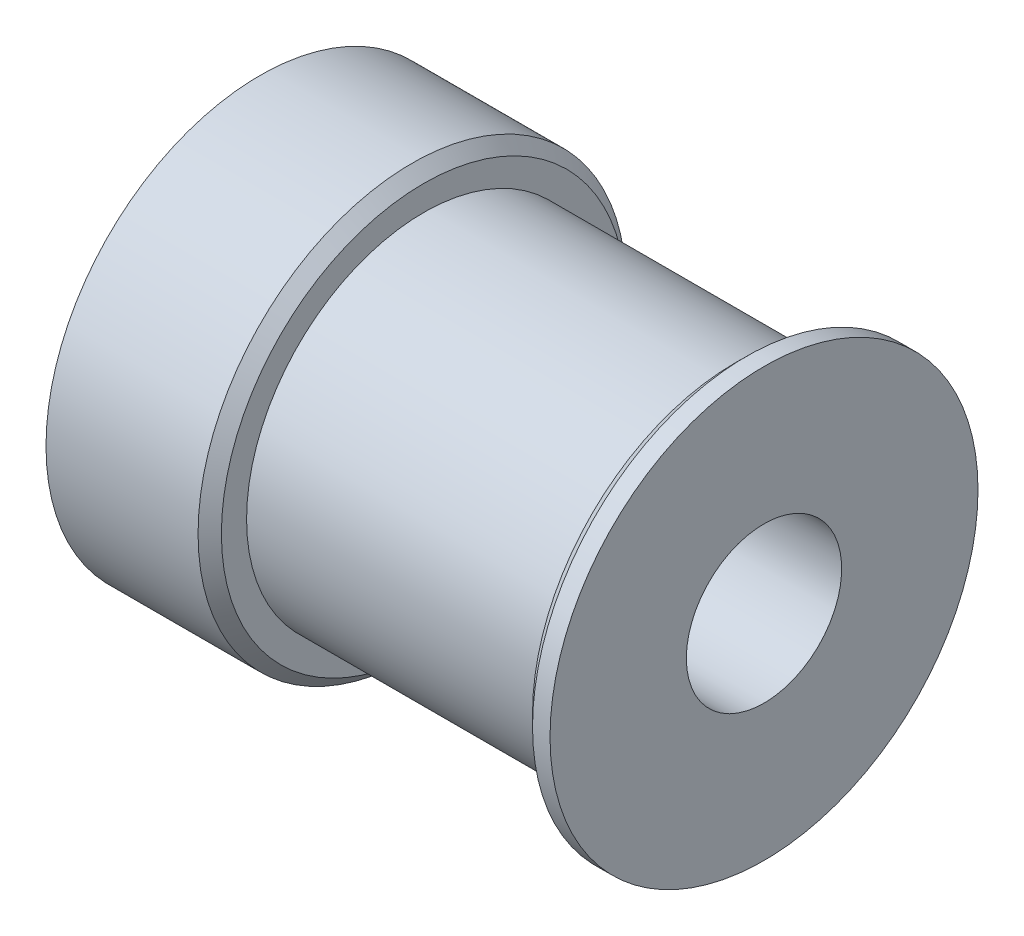
ISO-10303-21;
HEADER;
FILE_DESCRIPTION(('STEP AP214'),'2;1');
FILE_NAME('part.step','',(''),(''),'','','');
FILE_SCHEMA(('AUTOMOTIVE_DESIGN { 1 0 10303 214 1 1 1 1 }'));
ENDSEC;
DATA;
#1=APPLICATION_CONTEXT('core data for automotive mechanical design processes');
#2=APPLICATION_PROTOCOL_DEFINITION('international standard','automotive_design',2000,#1);
#3=PRODUCT_CONTEXT('',#1,'mechanical');
#4=PRODUCT('Part','Part','',(#3));
#5=PRODUCT_RELATED_PRODUCT_CATEGORY('part','',(#4));
#6=PRODUCT_DEFINITION_FORMATION('','',#4);
#7=PRODUCT_DEFINITION_CONTEXT('part definition',#1,'design');
#8=PRODUCT_DEFINITION('design','',#6,#7);
#9=PRODUCT_DEFINITION_SHAPE('','',#8);
#10=(LENGTH_UNIT() NAMED_UNIT(*) SI_UNIT(.MILLI.,.METRE.));
#11=(NAMED_UNIT(*) PLANE_ANGLE_UNIT() SI_UNIT($,.RADIAN.));
#12=(NAMED_UNIT(*) SI_UNIT($,.STERADIAN.) SOLID_ANGLE_UNIT());
#13=UNCERTAINTY_MEASURE_WITH_UNIT(LENGTH_MEASURE(1.E-05),#10,'distance_accuracy_value','');
#14=(GEOMETRIC_REPRESENTATION_CONTEXT(3) GLOBAL_UNCERTAINTY_ASSIGNED_CONTEXT((#13)) GLOBAL_UNIT_ASSIGNED_CONTEXT((#10,
#11,#12)) REPRESENTATION_CONTEXT('',''));
#15=CARTESIAN_POINT('',(0.,0.,0.));
#16=DIRECTION('',(0.,0.,1.));
#17=DIRECTION('',(1.,0.,0.));
#18=AXIS2_PLACEMENT_3D('',#15,#16,#17);
#19=CARTESIAN_POINT('',(-10.5863848396502,3.995,0.));
#20=DIRECTION('',(1.,0.,0.));
#21=DIRECTION('',(0.,0.,-1.));
#22=AXIS2_PLACEMENT_3D('',#19,#20,#21);
#23=PLANE('',#22);
#24=CARTESIAN_POINT('',(-10.5863848396502,0.,0.));
#25=DIRECTION('',(-1.,0.,0.));
#26=DIRECTION('',(0.,0.,1.));
#27=AXIS2_PLACEMENT_3D('',#24,#25,#26);
#28=CIRCLE('',#27,3.995);
#29=CARTESIAN_POINT('',(-10.5863848396502,0.,3.995));
#30=VERTEX_POINT('',#29);
#31=EDGE_CURVE('E130',#30,#30,#28,.T.);
#32=ORIENTED_EDGE('',*,*,#31,.F.);
#33=EDGE_LOOP('',(#32));
#34=FACE_BOUND('',#33,.T.);
#35=CARTESIAN_POINT('',(-10.5863848396502,0.,0.));
#36=DIRECTION('',(-1.,0.,0.));
#37=DIRECTION('',(0.,0.,1.));
#38=AXIS2_PLACEMENT_3D('',#35,#36,#37);
#39=CIRCLE('',#38,11.005);
#40=CARTESIAN_POINT('',(-10.5863848396502,0.,11.005));
#41=VERTEX_POINT('',#40);
#42=EDGE_CURVE('E51',#41,#41,#39,.T.);
#43=ORIENTED_EDGE('',*,*,#42,.T.);
#44=EDGE_LOOP('',(#43));
#45=FACE_BOUND('',#44,.T.);
#46=ADVANCED_FACE('F31',(#34,#45),#23,.F.);
#47=CARTESIAN_POINT('',(0.,0.,0.));
#48=DIRECTION('',(-1.,0.,0.));
#49=DIRECTION('',(0.,0.,1.));
#50=AXIS2_PLACEMENT_3D('',#47,#48,#49);
#51=CYLINDRICAL_SURFACE('',#50,11.005);
#52=CARTESIAN_POINT('',(-2.76638483965015,0.,0.));
#53=DIRECTION('',(-1.,0.,0.));
#54=DIRECTION('',(0.,0.,1.));
#55=AXIS2_PLACEMENT_3D('',#52,#53,#54);
#56=CIRCLE('',#55,11.005);
#57=CARTESIAN_POINT('',(-2.76638483965015,0.,11.005));
#58=VERTEX_POINT('',#57);
#59=EDGE_CURVE('E38',#58,#58,#56,.T.);
#60=ORIENTED_EDGE('',*,*,#59,.T.);
#61=EDGE_LOOP('',(#60));
#62=FACE_BOUND('',#61,.T.);
#63=CARTESIAN_POINT('',(-6.37638483965016,-10.8649677864226,1.75000000000004));
#64=CARTESIAN_POINT('',(-6.27875564989544,-10.8649694916064,1.74999602301459));
#65=CARTESIAN_POINT('',(-6.18107155983378,-10.8662979347631,1.74180252963995));
#66=CARTESIAN_POINT('',(-5.98843964425515,-10.8714639188173,1.70925666676721));
#67=CARTESIAN_POINT('',(-5.89349449972656,-10.8753038364768,1.68488899032538));
#68=CARTESIAN_POINT('',(-5.70915639548056,-10.8850471077965,1.62074662069772));
#69=CARTESIAN_POINT('',(-5.61975904141434,-10.8909488031277,1.58098430695179));
#70=CARTESIAN_POINT('',(-5.44891595170106,-10.9041486941611,1.48721143118511));
#71=CARTESIAN_POINT('',(-5.36746922898324,-10.9114467161755,1.43320264095433));
#72=CARTESIAN_POINT('',(-5.21409664057799,-10.9266902339174,1.31195211213936));
#73=CARTESIAN_POINT('',(-5.14225255934891,-10.9346404622033,1.24460750392155));
#74=CARTESIAN_POINT('',(-5.01083423974419,-10.9502504692677,1.0988192439057));
#75=CARTESIAN_POINT('',(-4.95126070342264,-10.9579102314068,1.02037495747718));
#76=CARTESIAN_POINT('',(-4.8457699857015,-10.9721260839702,0.85408690991924));
#77=CARTESIAN_POINT('',(-4.79992855043002,-10.9786759692509,0.766194520822879));
#78=CARTESIAN_POINT('',(-4.72368980285892,-10.989881522978,0.583835743244851));
#79=CARTESIAN_POINT('',(-4.69329157535639,-10.9945373036706,0.489369744708954));
#80=CARTESIAN_POINT('',(-4.64905125775586,-11.0013966685269,0.29738906255776));
#81=CARTESIAN_POINT('',(-4.63507195697558,-11.0036205646523,0.199906735509003));
#82=CARTESIAN_POINT('',(-4.62363993807174,-11.0054352942435,0.00395645500277206));
#83=CARTESIAN_POINT('',(-4.62618619302261,-11.0050262913221,-0.0945114368303926));
#84=CARTESIAN_POINT('',(-4.64762539993746,-11.001637456117,-0.288700508740375));
#85=CARTESIAN_POINT('',(-4.66637070958582,-10.9986808440948,-0.384438452056482));
#86=CARTESIAN_POINT('',(-4.71944377693937,-10.9905548695801,-0.571392458667171));
#87=CARTESIAN_POINT('',(-4.75377197525916,-10.9853854445194,-0.662608394018636));
#88=CARTESIAN_POINT('',(-4.83718517504666,-10.9733749600438,-0.838371853355376));
#89=CARTESIAN_POINT('',(-4.88633163346484,-10.9665269615087,-0.922889717834356));
#90=CARTESIAN_POINT('',(-4.99794131542398,-10.9519212841299,-1.08253455344542));
#91=CARTESIAN_POINT('',(-5.0604055221331,-10.944163538144,-1.15766083060397));
#92=CARTESIAN_POINT('',(-5.19769816413769,-10.9285010937218,-1.29726131130141));
#93=CARTESIAN_POINT('',(-5.27265557865962,-10.9205957186598,-1.36160865701711));
#94=CARTESIAN_POINT('',(-5.43237058599237,-10.9056122320807,-1.47683219989991));
#95=CARTESIAN_POINT('',(-5.51712825420994,-10.8985341269297,-1.52770829340434));
#96=CARTESIAN_POINT('',(-5.69417789876796,-10.8860064882961,-1.61456639284701));
#97=CARTESIAN_POINT('',(-5.78647696761673,-10.8805585108855,-1.65053418028916));
#98=CARTESIAN_POINT('',(-5.9759123382375,-10.8719345255966,-1.70642079649818));
#99=CARTESIAN_POINT('',(-6.07304825379961,-10.8687583366319,-1.72634090445641));
#100=CARTESIAN_POINT('',(-6.26826794976473,-10.8650722688855,-1.74939026800426));
#101=CARTESIAN_POINT('',(-6.36632991245014,-10.8645337510787,-1.75269988498944));
#102=CARTESIAN_POINT('',(-6.56160730463636,-10.8661078337943,-1.74291398581287));
#103=CARTESIAN_POINT('',(-6.6588227636665,-10.8682203414626,-1.72981904423304));
#104=CARTESIAN_POINT('',(-6.84908131822897,-10.8748320605633,-1.68774914522727));
#105=CARTESIAN_POINT('',(-6.94214502708317,-10.8793176075034,-1.65886507379704));
#106=CARTESIAN_POINT('',(-7.12211061061118,-10.8901586248279,-1.58613177998907));
#107=CARTESIAN_POINT('',(-7.20901214637249,-10.8965141979627,-1.54228173526964));
#108=CARTESIAN_POINT('',(-7.37499201562485,-10.9104461376956,-1.4404319517415));
#109=CARTESIAN_POINT('',(-7.45399824598429,-10.9180323412732,-1.38231607913724));
#110=CARTESIAN_POINT('',(-7.60120136555185,-10.9335415973798,-1.25374469544477));
#111=CARTESIAN_POINT('',(-7.66939756455878,-10.9414646713764,-1.18328839704649));
#112=CARTESIAN_POINT('',(-7.79369826263181,-10.9568450191339,-1.0312393174608));
#113=CARTESIAN_POINT('',(-7.84968283299482,-10.9642972032144,-0.949547902146971));
#114=CARTESIAN_POINT('',(-7.94713315845365,-10.9778156839733,-0.777814841909979));
#115=CARTESIAN_POINT('',(-7.98859934986523,-10.9838820222982,-0.687773448028692));
#116=CARTESIAN_POINT('',(-8.05564685579955,-10.993923094696,-0.502261191721235));
#117=CARTESIAN_POINT('',(-8.0812922515926,-10.9979062564397,-0.406813965022255));
#118=CARTESIAN_POINT('',(-8.11617704069885,-11.0033676936085,-0.212899336833813));
#119=CARTESIAN_POINT('',(-8.12541765793498,-11.0048461559032,-0.114432161213477));
#120=CARTESIAN_POINT('',(-8.12719788154438,-11.0051293329653,0.0815670735143751));
#121=CARTESIAN_POINT('',(-8.11992044113765,-11.0039633377308,0.179097477446532));
#122=CARTESIAN_POINT('',(-8.08926516642307,-10.9991480574674,0.371528467157263));
#123=CARTESIAN_POINT('',(-8.06588740324428,-10.9954987834093,0.466429064552045));
#124=CARTESIAN_POINT('',(-8.00376283369296,-10.9861252835372,0.65084591170194));
#125=CARTESIAN_POINT('',(-7.96503022954049,-10.9804029755637,0.740367049238215));
#126=CARTESIAN_POINT('',(-7.87331539727214,-10.9675098849339,0.911668383867845));
#127=CARTESIAN_POINT('',(-7.82033259278076,-10.9603390436919,0.993448267671069));
#128=CARTESIAN_POINT('',(-7.70096659691138,-10.9452505504538,1.14787034132481));
#129=CARTESIAN_POINT('',(-7.63444889092241,-10.9373258644241,1.22040787656462));
#130=CARTESIAN_POINT('',(-7.49018410785654,-10.9216730973817,1.35335675794192));
#131=CARTESIAN_POINT('',(-7.41243440307023,-10.9139450628743,1.41376525858447));
#132=CARTESIAN_POINT('',(-7.24732640756339,-10.8995075521419,1.52109167970866));
#133=CARTESIAN_POINT('',(-7.15991001286703,-10.8928048844696,1.56792112774678));
#134=CARTESIAN_POINT('',(-6.97838367097616,-10.8812571340208,1.64616089728005));
#135=CARTESIAN_POINT('',(-6.88428064564917,-10.8764101625431,1.67758690535849));
#136=CARTESIAN_POINT('',(-6.7208841865296,-10.8702187964121,1.71715731441487));
#137=CARTESIAN_POINT('',(-6.65258978684391,-10.8682603749163,1.72945399739872));
#138=CARTESIAN_POINT('',(-6.51500108740209,-10.8656342745896,1.74587668848285));
#139=CARTESIAN_POINT('',(-6.44570680324023,-10.8649665756505,1.75000282387312));
#140=CARTESIAN_POINT('',(-6.37638483965016,-10.8649677864226,1.75000000000004));
#141=B_SPLINE_CURVE_WITH_KNOTS('',3,(#63,#64,#65,#66,#67,#68,#69,#70,#71,#72,#73,#74,#75,#76,
#77,#78,#79,#80,#81,#82,#83,#84,#85,#86,#87,#88,#89,#90,#91,#92,#93,#94,#95,#96,#97,#98,#99,
#100,#101,#102,#103,#104,#105,#106,#107,#108,#109,#110,#111,#112,#113,#114,#115,#116,#117,#118,
#119,#120,#121,#122,#123,#124,#125,#126,#127,#128,#129,#130,#131,#132,#133,#134,#135,#136,#137,
#138,#139,#140),.UNSPECIFIED.,.T.,.F.,(4,2,2,2,2,2,2,2,2,2,2,2,2,2,2,2,2,2,2,2,2,2,2,2,2,2,2,2,
2,2,2,2,2,2,2,2,2,2,4),(0.,0.292634128170553,0.585545595414746,0.878222008487918,
1.17086203945359,1.46585413757004,1.76086310884996,2.05747058792093,2.35406048724384,
2.64815378117752,2.94222879983902,3.23365147810622,3.52508239702041,3.81773901631135,
4.11041724814141,4.40632908244842,4.70224319376153,4.99843888138603,5.29461095634625,
5.58756004626574,5.88049887571103,6.17176896900574,6.46305506941898,6.75679601818856,
7.05055571424524,7.34708204257179,7.64359945873092,7.93890782318109,8.23419415442473,
8.52622588859176,8.81825633260985,9.11001729549212,9.40179006095693,9.69661817589636,
9.99151537747112,10.2882928579732,10.5847674744652,10.7925566456576,11.0003425796515),.UNSPECIFIED.);
#142=CARTESIAN_POINT('',(-6.37638483965016,-10.8649677864226,1.75000000000004));
#143=VERTEX_POINT('',#142);
#144=EDGE_CURVE('E59',#143,#143,#141,.T.);
#145=ORIENTED_EDGE('',*,*,#144,.T.);
#146=EDGE_LOOP('',(#145));
#147=FACE_BOUND('',#146,.T.);
#148=CARTESIAN_POINT('',(-4.62638483965016,0.,-11.005));
#149=CARTESIAN_POINT('',(-4.62638880920645,0.0976379879757944,-11.0049983735711));
#150=CARTESIAN_POINT('',(-4.63458372956067,0.195330853503295,-11.0036870380277));
#151=CARTESIAN_POINT('',(-4.66713577467557,0.38798099709675,-10.998582102473));
#152=CARTESIAN_POINT('',(-4.69150817428676,0.482935601183339,-10.9947861565283));
#153=CARTESIAN_POINT('',(-4.75566435619124,0.667293723706856,-10.9851381495617));
#154=CARTESIAN_POINT('',(-4.79543598213992,0.756701556403332,-10.9792877107207));
#155=CARTESIAN_POINT('',(-4.88923079893324,0.927562260653505,-10.9661754967891));
#156=CARTESIAN_POINT('',(-4.94325219578225,1.00901613181525,-10.9589138993887));
#157=CARTESIAN_POINT('',(-5.06451555791497,1.1623808835496,-10.9437146074467));
#158=CARTESIAN_POINT('',(-5.13185756797195,1.23421218876728,-10.9357720715502));
#159=CARTESIAN_POINT('',(-5.27763523626369,1.36560578310539,-10.9201435240471));
#160=CARTESIAN_POINT('',(-5.35607156430421,1.42516733092067,-10.9124575279634));
#161=CARTESIAN_POINT('',(-5.52235240577917,1.53064532361661,-10.8981653828135));
#162=CARTESIAN_POINT('',(-5.61024691645186,1.57648387190399,-10.8915654906567));
#163=CARTESIAN_POINT('',(-5.79261029658337,1.65271670000419,-10.880259505857));
#164=CARTESIAN_POINT('',(-5.88707876225264,1.68311192743596,-10.8755532970193));
#165=CARTESIAN_POINT('',(-6.07906795282237,1.72734625340389,-10.8686154602757));
#166=CARTESIAN_POINT('',(-6.17655639382931,1.74132220686268,-10.8663633886903));
#167=CARTESIAN_POINT('',(-6.37251871606897,1.7527454116231,-10.8645268715548));
#168=CARTESIAN_POINT('',(-6.47099253338011,1.75019372822462,-10.8649422540722));
#169=CARTESIAN_POINT('',(-6.66515817412189,1.72874573755192,-10.8683750325878));
#170=CARTESIAN_POINT('',(-6.7608674043526,1.71000254506253,-10.8713680523848));
#171=CARTESIAN_POINT('',(-6.94776508565194,1.65694359159775,-10.8795807482602));
#172=CARTESIAN_POINT('',(-7.03895339431674,1.62262734043419,-10.8848004944282));
#173=CARTESIAN_POINT('',(-7.21468263375545,1.53923925859875,-10.8969051220884));
#174=CARTESIAN_POINT('',(-7.29919259154708,1.49010324707008,-10.9037972202345));
#175=CARTESIAN_POINT('',(-7.45882600558572,1.37851606851503,-10.9184648812809));
#176=CARTESIAN_POINT('',(-7.53394877018993,1.31606392128008,-10.9262405091986));
#177=CARTESIAN_POINT('',(-7.67356215999975,1.17878007668056,-10.9419065036017));
#178=CARTESIAN_POINT('',(-7.73792351500074,1.10381687909397,-10.9497971760545));
#179=CARTESIAN_POINT('',(-7.85317260248697,0.944085225570313,-10.9647230553611));
#180=CARTESIAN_POINT('',(-7.90406026197882,0.859316716516799,-10.9717582575802));
#181=CARTESIAN_POINT('',(-7.99092678821638,0.682263640656775,-10.9841892280718));
#182=CARTESIAN_POINT('',(-8.02689491747552,0.589973717694693,-10.9895838148619));
#183=CARTESIAN_POINT('',(-8.0827849966669,0.400558298685616,-10.9981160722856));
#184=CARTESIAN_POINT('',(-8.10270816723225,0.303433171077714,-11.001253914601));
#185=CARTESIAN_POINT('',(-8.12576912105926,0.108219263965093,-11.0048962121308));
#186=CARTESIAN_POINT('',(-8.12908448693273,0.010151963761354,-11.0054285261173));
#187=CARTESIAN_POINT('',(-8.1193081803818,-0.185137465179281,-11.0038758716671));
#188=CARTESIAN_POINT('',(-8.10621708084671,-0.282359623307915,-11.0017909946189));
#189=CARTESIAN_POINT('',(-8.06414714374553,-0.47265547349901,-10.9952554526825));
#190=CARTESIAN_POINT('',(-8.03525556422922,-0.565748941080359,-10.9908177851386));
#191=CARTESIAN_POINT('',(-7.96249734007517,-0.745770738366731,-10.980072413782));
#192=CARTESIAN_POINT('',(-7.91862991821455,-0.83269874781123,-10.9737646129147));
#193=CARTESIAN_POINT('',(-7.81675386325276,-0.99869791527865,-10.9599101102399));
#194=CARTESIAN_POINT('',(-7.75863349029645,-1.07769967827774,-10.9523537809111));
#195=CARTESIAN_POINT('',(-7.63005594007277,-1.22489170233687,-10.9368712610847));
#196=CARTESIAN_POINT('',(-7.55959795169349,-1.29308125200752,-10.9289450462949));
#197=CARTESIAN_POINT('',(-7.4075514941104,-1.41736577223755,-10.9135268254945));
#198=CARTESIAN_POINT('',(-7.32586474778272,-1.47334119728038,-10.9060395940498));
#199=CARTESIAN_POINT('',(-7.15414363820159,-1.57077549729447,-10.8924340580026));
#200=CARTESIAN_POINT('',(-7.06410952185587,-1.61223480146642,-10.886315712928));
#201=CARTESIAN_POINT('',(-6.8785941284918,-1.67927811775171,-10.8761759334255));
#202=CARTESIAN_POINT('',(-6.78313539519866,-1.70492323680364,-10.8721464373104));
#203=CARTESIAN_POINT('',(-6.58919635293697,-1.7398035801039,-10.866619792171));
#204=CARTESIAN_POINT('',(-6.49071628158279,-1.74904009146568,-10.865122444522));
#205=CARTESIAN_POINT('',(-6.29472272194748,-1.75080761094841,-10.8648376586723));
#206=CARTESIAN_POINT('',(-6.19721092250029,-1.74352668641723,-10.8660197127072));
#207=CARTESIAN_POINT('',(-6.00481805058491,-1.71287095773792,-10.8708939445795));
#208=CARTESIAN_POINT('',(-5.90993697171421,-1.68949619276176,-10.8745861163073));
#209=CARTESIAN_POINT('',(-5.72556190115534,-1.62738576953246,-10.8840534106507));
#210=CARTESIAN_POINT('',(-5.63606282759747,-1.58866487249639,-10.8898265311509));
#211=CARTESIAN_POINT('',(-5.46480078783857,-1.49698033657708,-10.9028073999666));
#212=CARTESIAN_POINT('',(-5.38303814861327,-1.44401609607069,-10.9100152088785));
#213=CARTESIAN_POINT('',(-5.22861718552694,-1.32467140198418,-10.9251506878689));
#214=CARTESIAN_POINT('',(-5.15606680921633,-1.2581521360587,-10.9330852960958));
#215=CARTESIAN_POINT('',(-5.02309274404159,-1.11387883322309,-10.9487237944648));
#216=CARTESIAN_POINT('',(-4.96267186600151,-1.03612219938978,-10.9564276307779));
#217=CARTESIAN_POINT('',(-4.85533106096996,-0.871007716111391,-10.970791884614));
#218=CARTESIAN_POINT('',(-4.80849764678914,-0.783593034670629,-10.977445498091));
#219=CARTESIAN_POINT('',(-4.73024999770739,-0.602070124389866,-10.9888932428123));
#220=CARTESIAN_POINT('',(-4.69882011601511,-0.507968799543904,-10.9936892599457));
#221=CARTESIAN_POINT('',(-4.65923957780887,-0.344562164662293,-10.9998120267978));
#222=CARTESIAN_POINT('',(-4.64693835360418,-0.276255193174896,-11.0017473109977));
#223=CARTESIAN_POINT('',(-4.63050963578979,-0.138641362212051,-11.0043418656025));
#224=CARTESIAN_POINT('',(-4.62638202079577,-0.0693345176008767,-11.0050011549569));
#225=CARTESIAN_POINT('',(-4.62638483965016,0.,-11.005));
#226=B_SPLINE_CURVE_WITH_KNOTS('',3,(#148,#149,#150,#151,#152,#153,#154,#155,#156,#157,#158,
#159,#160,#161,#162,#163,#164,#165,#166,#167,#168,#169,#170,#171,#172,#173,#174,#175,#176,#177,
#178,#179,#180,#181,#182,#183,#184,#185,#186,#187,#188,#189,#190,#191,#192,#193,#194,#195,#196,
#197,#198,#199,#200,#201,#202,#203,#204,#205,#206,#207,#208,#209,#210,#211,#212,#213,#214,#215,
#216,#217,#218,#219,#220,#221,#222,#223,#224,#225),.UNSPECIFIED.,.T.,.F.,(4,2,2,2,2,2,2,2,2,2,2,
2,2,2,2,2,2,2,2,2,2,2,2,2,2,2,2,2,2,2,2,2,2,2,2,2,2,2,4),(0.,0.292660565236477,0.58559785575936,
0.878304367798746,1.17097404669961,1.46593153851999,1.76090684564168,2.05752610276867,
2.35412715681695,2.6482380905704,2.94233006739542,3.23367103776298,3.52502117921285,
3.81765166219281,4.11030369331529,4.40625164360713,4.70220119715661,4.99836337561774,
5.29450302117457,5.58746926629496,5.88042528175621,6.17177955101898,6.46314894341372,
6.75688003733683,7.05063044927991,7.34713840896221,7.64363760100113,7.93898380354323,
8.23430683770519,8.52628422572261,8.81826090307733,9.10995741136951,9.40166624253694,
9.69652778713647,9.99145758267256,10.2882259655876,10.5846922653741,10.7925189615486,
11.0003425713151),.UNSPECIFIED.);
#227=CARTESIAN_POINT('',(-4.62638483965016,0.,-11.005));
#228=VERTEX_POINT('',#227);
#229=EDGE_CURVE('E82',#228,#228,#226,.T.);
#230=ORIENTED_EDGE('',*,*,#229,.T.);
#231=EDGE_LOOP('',(#230));
#232=FACE_BOUND('',#231,.T.);
#233=ORIENTED_EDGE('',*,*,#42,.F.);
#234=EDGE_LOOP('',(#233));
#235=FACE_BOUND('',#234,.T.);
#236=ADVANCED_FACE('F86',(#62,#147,#232,#235),#51,.T.);
#237=CARTESIAN_POINT('',(-2.16638483965016,9.11,0.));
#238=DIRECTION('',(-1.,0.,0.));
#239=DIRECTION('',(0.,0.,1.));
#240=AXIS2_PLACEMENT_3D('',#237,#238,#239);
#241=PLANE('',#240);
#242=CARTESIAN_POINT('',(-2.16638483965016,0.,0.));
#243=DIRECTION('',(-1.,0.,0.));
#244=DIRECTION('',(0.,0.,1.));
#245=AXIS2_PLACEMENT_3D('',#242,#243,#244);
#246=CIRCLE('',#245,10.405);
#247=CARTESIAN_POINT('',(-2.16638483965016,0.,10.405));
#248=VERTEX_POINT('',#247);
#249=EDGE_CURVE('E10',#248,#248,#246,.F.);
#250=ORIENTED_EDGE('',*,*,#249,.T.);
#251=EDGE_LOOP('',(#250));
#252=FACE_BOUND('',#251,.T.);
#253=CARTESIAN_POINT('',(-2.16638483965016,0.,0.));
#254=DIRECTION('',(-1.,0.,0.));
#255=DIRECTION('',(0.,0.,1.));
#256=AXIS2_PLACEMENT_3D('',#253,#254,#255);
#257=CIRCLE('',#256,9.11);
#258=CARTESIAN_POINT('',(-2.16638483965016,0.,9.11));
#259=VERTEX_POINT('',#258);
#260=EDGE_CURVE('E116',#259,#259,#257,.T.);
#261=ORIENTED_EDGE('',*,*,#260,.T.);
#262=EDGE_LOOP('',(#261));
#263=FACE_BOUND('',#262,.T.);
#264=ADVANCED_FACE('F91',(#252,#263),#241,.F.);
#265=CARTESIAN_POINT('',(0.,0.,0.));
#266=DIRECTION('',(-1.,0.,0.));
#267=DIRECTION('',(0.,0.,1.));
#268=AXIS2_PLACEMENT_3D('',#265,#266,#267);
#269=CYLINDRICAL_SURFACE('',#268,9.11);
#270=ORIENTED_EDGE('',*,*,#260,.F.);
#271=EDGE_LOOP('',(#270));
#272=FACE_BOUND('',#271,.T.);
#273=CARTESIAN_POINT('',(13.8336151603498,0.,0.));
#274=DIRECTION('',(-1.,0.,0.));
#275=DIRECTION('',(0.,0.,1.));
#276=AXIS2_PLACEMENT_3D('',#273,#274,#275);
#277=CIRCLE('',#276,9.11);
#278=CARTESIAN_POINT('',(13.8336151603498,0.,9.11));
#279=VERTEX_POINT('',#278);
#280=EDGE_CURVE('E114',#279,#279,#277,.T.);
#281=ORIENTED_EDGE('',*,*,#280,.T.);
#282=EDGE_LOOP('',(#281));
#283=FACE_BOUND('',#282,.T.);
#284=ADVANCED_FACE('F110',(#272,#283),#269,.T.);
#285=CARTESIAN_POINT('',(13.8336151603498,9.11,0.));
#286=DIRECTION('',(1.,0.,0.));
#287=DIRECTION('',(0.,0.,-1.));
#288=AXIS2_PLACEMENT_3D('',#285,#286,#287);
#289=PLANE('',#288);
#290=CARTESIAN_POINT('',(13.8336151603498,0.,0.));
#291=DIRECTION('',(1.,0.,0.));
#292=DIRECTION('',(0.,0.,-1.));
#293=AXIS2_PLACEMENT_3D('',#290,#291,#292);
#294=CIRCLE('',#293,10.405);
#295=CARTESIAN_POINT('',(13.8336151603498,0.,-10.405));
#296=VERTEX_POINT('',#295);
#297=EDGE_CURVE('E46',#296,#296,#294,.F.);
#298=ORIENTED_EDGE('',*,*,#297,.T.);
#299=EDGE_LOOP('',(#298));
#300=FACE_BOUND('',#299,.T.);
#301=ORIENTED_EDGE('',*,*,#280,.F.);
#302=EDGE_LOOP('',(#301));
#303=FACE_BOUND('',#302,.T.);
#304=ADVANCED_FACE('F106',(#300,#303),#289,.F.);
#305=CARTESIAN_POINT('',(0.,0.,0.));
#306=DIRECTION('',(-1.,0.,0.));
#307=DIRECTION('',(0.,0.,1.));
#308=AXIS2_PLACEMENT_3D('',#305,#306,#307);
#309=CYLINDRICAL_SURFACE('',#308,11.005);
#310=CARTESIAN_POINT('',(14.4336151603498,0.,0.));
#311=DIRECTION('',(1.,0.,0.));
#312=DIRECTION('',(0.,0.,-1.));
#313=AXIS2_PLACEMENT_3D('',#310,#311,#312);
#314=CIRCLE('',#313,11.005);
#315=CARTESIAN_POINT('',(14.4336151603498,0.,-11.005));
#316=VERTEX_POINT('',#315);
#317=EDGE_CURVE('E42',#316,#316,#314,.T.);
#318=ORIENTED_EDGE('',*,*,#317,.T.);
#319=EDGE_LOOP('',(#318));
#320=FACE_BOUND('',#319,.T.);
#321=CARTESIAN_POINT('',(15.3336151603498,0.,0.));
#322=DIRECTION('',(-1.,0.,0.));
#323=DIRECTION('',(0.,0.,1.));
#324=AXIS2_PLACEMENT_3D('',#321,#322,#323);
#325=CIRCLE('',#324,11.005);
#326=CARTESIAN_POINT('',(15.3336151603498,0.,11.005));
#327=VERTEX_POINT('',#326);
#328=EDGE_CURVE('E117',#327,#327,#325,.T.);
#329=ORIENTED_EDGE('',*,*,#328,.T.);
#330=EDGE_LOOP('',(#329));
#331=FACE_BOUND('',#330,.T.);
#332=ADVANCED_FACE('F109',(#320,#331),#309,.T.);
#333=CARTESIAN_POINT('',(15.3336151603498,3.995,0.));
#334=DIRECTION('',(-1.,0.,0.));
#335=DIRECTION('',(0.,0.,1.));
#336=AXIS2_PLACEMENT_3D('',#333,#334,#335);
#337=PLANE('',#336);
#338=ORIENTED_EDGE('',*,*,#328,.F.);
#339=EDGE_LOOP('',(#338));
#340=FACE_BOUND('',#339,.T.);
#341=CARTESIAN_POINT('',(15.3336151603498,0.,0.));
#342=DIRECTION('',(-1.,0.,0.));
#343=DIRECTION('',(0.,0.,1.));
#344=AXIS2_PLACEMENT_3D('',#341,#342,#343);
#345=CIRCLE('',#344,3.995);
#346=CARTESIAN_POINT('',(15.3336151603498,0.,3.995));
#347=VERTEX_POINT('',#346);
#348=EDGE_CURVE('E122',#347,#347,#345,.T.);
#349=ORIENTED_EDGE('',*,*,#348,.T.);
#350=EDGE_LOOP('',(#349));
#351=FACE_BOUND('',#350,.T.);
#352=ADVANCED_FACE('F147',(#340,#351),#337,.F.);
#353=CARTESIAN_POINT('',(0.,0.,0.));
#354=DIRECTION('',(-1.,0.,0.));
#355=DIRECTION('',(0.,0.,1.));
#356=AXIS2_PLACEMENT_3D('',#353,#354,#355);
#357=CYLINDRICAL_SURFACE('',#356,3.995);
#358=CARTESIAN_POINT('',(-6.37638483965016,-3.59131243419449,1.75000000000001));
#359=CARTESIAN_POINT('',(-6.46920856067517,-3.59131701710379,1.74999575324021));
#360=CARTESIAN_POINT('',(-6.56218618188808,-3.59496328179706,1.74256773930113));
#361=CARTESIAN_POINT('',(-6.74541509807789,-3.60905905743933,1.71317560599182));
#362=CARTESIAN_POINT('',(-6.83565873180508,-3.61952611433385,1.69117399478829));
#363=CARTESIAN_POINT('',(-7.01044065879885,-3.6458348395026,1.63367642518377));
#364=CARTESIAN_POINT('',(-7.09500200281182,-3.66165299662239,1.59823941708571));
#365=CARTESIAN_POINT('',(-7.25695693749664,-3.69684592039027,1.51505364733799));
#366=CARTESIAN_POINT('',(-7.33435169839832,-3.71622010482915,1.4673069005785));
#367=CARTESIAN_POINT('',(-7.4851556831418,-3.75783400007592,1.35733946859375));
#368=CARTESIAN_POINT('',(-7.55801256456173,-3.7801771557608,1.2944000986134));
#369=CARTESIAN_POINT('',(-7.69255037428529,-3.82436564195849,1.15733986226223));
#370=CARTESIAN_POINT('',(-7.75422672102254,-3.84621076519607,1.08321443475906));
#371=CARTESIAN_POINT('',(-7.86757700938578,-3.88822196561616,0.92144641048631));
#372=CARTESIAN_POINT('',(-7.91861544210423,-3.90825396046259,0.833320500051198));
#373=CARTESIAN_POINT('',(-8.00489993092916,-3.94309804173771,0.64869561285448));
#374=CARTESIAN_POINT('',(-8.04015369884359,-3.95791267642032,0.552200752422672));
#375=CARTESIAN_POINT('',(-8.0918224917898,-3.97991667087864,0.359389846957518));
#376=CARTESIAN_POINT('',(-8.10919383169193,-3.98749135526514,0.263374969068302));
#377=CARTESIAN_POINT('',(-8.1277090711867,-3.99557098475089,0.069514937067978));
#378=CARTESIAN_POINT('',(-8.12886029356441,-3.99607912013515,-0.0283293711434943));
#379=CARTESIAN_POINT('',(-8.11537244648357,-3.99018490766646,-0.216062029310302));
#380=CARTESIAN_POINT('',(-8.10178827905712,-3.98424420903011,-0.306043504497339));
#381=CARTESIAN_POINT('',(-8.06104250131365,-3.96676935615993,-0.482298608644567));
#382=CARTESIAN_POINT('',(-8.03387988620493,-3.95523478798717,-0.568571962694313));
#383=CARTESIAN_POINT('',(-7.96644738942268,-3.9274506819562,-0.736560854490425));
#384=CARTESIAN_POINT('',(-7.92598351494741,-3.91113177265863,-0.818186573224962));
#385=CARTESIAN_POINT('',(-7.8333003780357,-3.87534546156287,-0.973704128858783));
#386=CARTESIAN_POINT('',(-7.78107685127613,-3.8558769183571,-1.04759314597549));
#387=CARTESIAN_POINT('',(-7.66171033429825,-3.81395211408563,-1.19157041167809));
#388=CARTESIAN_POINT('',(-7.59373006560545,-3.791381226339,-1.26093206392112));
#389=CARTESIAN_POINT('',(-7.44710660279927,-3.74687789338,-1.38760516598348));
#390=CARTESIAN_POINT('',(-7.36845842088098,-3.72494575267677,-1.44491094689107));
#391=CARTESIAN_POINT('',(-7.19884046223167,-3.68333388406915,-1.54799701294655));
#392=CARTESIAN_POINT('',(-7.10750661782823,-3.66377739536154,-1.59323243120704));
#393=CARTESIAN_POINT('',(-6.91743683592585,-3.63064006430998,-1.66737700841786));
#394=CARTESIAN_POINT('',(-6.81870690579993,-3.61705443251048,-1.69629925808929));
#395=CARTESIAN_POINT('',(-6.62394798669135,-3.59862240883322,-1.73504295939253));
#396=CARTESIAN_POINT('',(-6.52820748531903,-3.59323468920231,-1.74605127391717));
#397=CARTESIAN_POINT('',(-6.33611601385967,-3.59025640094896,-1.7521705247656));
#398=CARTESIAN_POINT('',(-6.2397653112694,-3.59266262384135,-1.74728800276995));
#399=CARTESIAN_POINT('',(-6.05672435116483,-3.60443724765739,-1.72284989089635));
#400=CARTESIAN_POINT('',(-5.96984692018449,-3.61327713888087,-1.70440712252733));
#401=CARTESIAN_POINT('',(-5.80051127427642,-3.63622162509197,-1.65488858886372));
#402=CARTESIAN_POINT('',(-5.71805417340676,-3.65032754021065,-1.62380965565502));
#403=CARTESIAN_POINT('',(-5.55580677496781,-3.68297036820467,-1.54838899206729));
#404=CARTESIAN_POINT('',(-5.47629615048552,-3.70167579980637,-1.50352101497707));
#405=CARTESIAN_POINT('',(-5.32552602014817,-3.74119301350358,-1.4023013858516));
#406=CARTESIAN_POINT('',(-5.25427035429059,-3.76200576750326,-1.3459444228028));
#407=CARTESIAN_POINT('',(-5.11521789256706,-3.80569507593149,-1.21726411204762));
#408=CARTESIAN_POINT('',(-5.04833837202625,-3.82858577149879,-1.14395023459048));
#409=CARTESIAN_POINT('',(-4.92763641678056,-3.87210834418128,-0.986638917709302));
#410=CARTESIAN_POINT('',(-4.87381560091377,-3.8927399410708,-0.902640155686018));
#411=CARTESIAN_POINT('',(-4.78058979915673,-3.92966129254032,-0.725284653417696));
#412=CARTESIAN_POINT('',(-4.74128853321501,-3.94591959079437,-0.631866430549813));
#413=CARTESIAN_POINT('',(-4.67927678426136,-3.97201485726516,-0.438840864963403));
#414=CARTESIAN_POINT('',(-4.65655527190618,-3.98185609383692,-0.339237684609576));
#415=CARTESIAN_POINT('',(-4.62984089588281,-3.99347109343751,-0.14482185085958));
#416=CARTESIAN_POINT('',(-4.62455871437841,-3.99579992824602,-0.0502185186796694));
#417=CARTESIAN_POINT('',(-4.62932487386563,-3.99371218946244,0.13851418074189));
#418=CARTESIAN_POINT('',(-4.63936999783586,-3.98929703135505,0.232643643283106));
#419=CARTESIAN_POINT('',(-4.67358301538859,-3.974523516642,0.413635231222307));
#420=CARTESIAN_POINT('',(-4.69713685042036,-3.96442390540306,0.500636400175258));
#421=CARTESIAN_POINT('',(-4.75699246666573,-3.93944402367911,0.669394267127079));
#422=CARTESIAN_POINT('',(-4.79329652958816,-3.92456289756178,0.751150023337379));
#423=CARTESIAN_POINT('',(-4.87945930323832,-3.89058791998424,0.911237257800739));
#424=CARTESIAN_POINT('',(-4.92986268314973,-3.87133233560878,0.989240389528128));
#425=CARTESIAN_POINT('',(-5.04203381205792,-3.83083331236429,1.13602296826647));
#426=CARTESIAN_POINT('',(-5.10380625237848,-3.80958905467479,1.20479858731071));
#427=CARTESIAN_POINT('',(-5.2424965492693,-3.76544625203544,1.33665107967075));
#428=CARTESIAN_POINT('',(-5.32021037775937,-3.74254516152245,1.39889275781694));
#429=CARTESIAN_POINT('',(-5.48562430191591,-3.69927288991233,1.50961959452955));
#430=CARTESIAN_POINT('',(-5.57333040158426,-3.67890324540262,1.5580964205457));
#431=CARTESIAN_POINT('',(-5.7567619746373,-3.64326246701655,1.63971366093426));
#432=CARTESIAN_POINT('',(-5.85249884086463,-3.62799873503811,1.6728318369246));
#433=CARTESIAN_POINT('',(-6.04892986796739,-3.60490392733031,1.72204944443619));
#434=CARTESIAN_POINT('',(-6.14960619515607,-3.59704792414228,1.73820597389172));
#435=CARTESIAN_POINT('',(-6.27175350035295,-3.59277448033203,1.74699586670123));
#436=CARTESIAN_POINT('',(-6.29265782440058,-3.59222734493717,1.74812134336348));
#437=CARTESIAN_POINT('',(-6.33450043280801,-3.59149580070527,1.74962389759285));
#438=CARTESIAN_POINT('',(-6.35543871792215,-3.59131140003883,1.75000095830191));
#439=CARTESIAN_POINT('',(-6.37638483965016,-3.59131243419449,1.75000000000001));
#440=B_SPLINE_CURVE_WITH_KNOTS('',3,(#358,#359,#360,#361,#362,#363,#364,#365,#366,#367,#368,
#369,#370,#371,#372,#373,#374,#375,#376,#377,#378,#379,#380,#381,#382,#383,#384,#385,#386,#387,
#388,#389,#390,#391,#392,#393,#394,#395,#396,#397,#398,#399,#400,#401,#402,#403,#404,#405,#406,
#407,#408,#409,#410,#411,#412,#413,#414,#415,#416,#417,#418,#419,#420,#421,#422,#423,#424,#425,
#426,#427,#428,#429,#430,#431,#432,#433,#434,#435,#436,#437,#438,#439),.UNSPECIFIED.,.T.,.F.,(4,
2,2,2,2,2,2,2,2,2,2,2,2,2,2,2,2,2,2,2,2,2,2,2,2,2,2,2,2,2,2,2,2,2,2,2,2,2,2,2,4),(0.,
0.278382972823401,0.557484905787431,0.835376139574623,1.11322191624578,1.4084518222918,
1.70380243569479,2.01357561488214,2.32319728467839,2.61523220587402,2.90713527984224,
3.17944126407838,3.45176740167121,3.72825591711511,4.00484485563936,4.30265540945383,
4.60060568828318,4.91032868654689,5.21980278853326,5.50778774611829,5.79565416574783,
6.06221327617646,6.3288392548022,6.60726907487547,6.88582789775572,7.18994599799012,
7.49410177935182,7.80039009813828,8.10647447864632,8.3893529388635,8.67217203438125,
8.94305259518923,9.21398165597476,9.49731977544861,9.78077507463427,10.085857847507,
10.3911249103512,10.6968326116255,11.0015078775948,11.0643249272848,11.1271433919119),.UNSPECIFIED.);
#441=CARTESIAN_POINT('',(-6.37638483965016,-3.59131243419449,1.75000000000001));
#442=VERTEX_POINT('',#441);
#443=EDGE_CURVE('E52',#442,#442,#440,.T.);
#444=ORIENTED_EDGE('',*,*,#443,.T.);
#445=EDGE_LOOP('',(#444));
#446=FACE_BOUND('',#445,.T.);
#447=CARTESIAN_POINT('',(-4.62638483965016,0.,-3.995));
#448=CARTESIAN_POINT('',(-4.62638897065122,-0.0933097781555759,-3.99499664581293));
#449=CARTESIAN_POINT('',(-4.63389165816022,-0.186769098768965,-3.9916942276159));
#450=CARTESIAN_POINT('',(-4.66360866443549,-0.371006684499984,-3.97881305606959));
#451=CARTESIAN_POINT('',(-4.6858590738701,-0.461777800314997,-3.96921890618752));
#452=CARTESIAN_POINT('',(-4.74408225866561,-0.637682023395732,-3.94477428257667));
#453=CARTESIAN_POINT('',(-4.78000662996023,-0.722833788946485,-3.92994236310297));
#454=CARTESIAN_POINT('',(-4.86434510734139,-0.885810949378597,-3.89644646580293));
#455=CARTESIAN_POINT('',(-4.91275614977346,-0.963638134990802,-3.87778342818564));
#456=CARTESIAN_POINT('',(-5.02346238400729,-1.11411548576912,-3.83733512545959));
#457=CARTESIAN_POINT('',(-5.0863276869119,-1.18631661294875,-3.81544083413829));
#458=CARTESIAN_POINT('',(-5.22294869797926,-1.31954462183553,-3.77143991377929));
#459=CARTESIAN_POINT('',(-5.29671067000639,-1.3805650308931,-3.74933316949416));
#460=CARTESIAN_POINT('',(-5.45799891157336,-1.49307093654697,-3.70602246017093));
#461=CARTESIAN_POINT('',(-5.54606296653073,-1.54383614157746,-3.6849373415205));
#462=CARTESIAN_POINT('',(-5.73053131221904,-1.6296329701192,-3.64781069580653));
#463=CARTESIAN_POINT('',(-5.82693082924473,-1.6646735288585,-3.63176630600417));
#464=CARTESIAN_POINT('',(-6.02016801881729,-1.71612354099199,-3.60773038922077));
#465=CARTESIAN_POINT('',(-6.11672616193165,-1.73340142473576,-3.59936589905474));
#466=CARTESIAN_POINT('',(-6.31170515281196,-1.75153826523015,-3.59057814404999));
#467=CARTESIAN_POINT('',(-6.41012477008051,-1.75240771324456,-3.59014980497975));
#468=CARTESIAN_POINT('',(-6.59693786381539,-1.73835214080658,-3.59697055271373));
#469=CARTESIAN_POINT('',(-6.68546273005729,-1.72478565351689,-3.60355932204863));
#470=CARTESIAN_POINT('',(-6.85882278834243,-1.68454018568956,-3.62254594577934));
#471=CARTESIAN_POINT('',(-6.94365717740776,-1.65785836688351,-3.63494505755517));
#472=CARTESIAN_POINT('',(-7.10947772542333,-1.59161148956881,-3.66444162129082));
#473=CARTESIAN_POINT('',(-7.19033653958797,-1.551773412807,-3.68163732242386));
#474=CARTESIAN_POINT('',(-7.34455710561376,-1.46054034509871,-3.7187725189719));
#475=CARTESIAN_POINT('',(-7.41791572407632,-1.40914055241409,-3.73871315305595));
#476=CARTESIAN_POINT('',(-7.56233884960688,-1.29055969258282,-3.78137656846525));
#477=CARTESIAN_POINT('',(-7.63253399205541,-1.22234726346277,-3.80418434254487));
#478=CARTESIAN_POINT('',(-7.76079794745662,-1.07491870960645,-3.8484406350897));
#479=CARTESIAN_POINT('',(-7.81886329784483,-0.995699453583344,-3.86988876421761));
#480=CARTESIAN_POINT('',(-7.92268206752728,-0.825626169740073,-3.90975635086204));
#481=CARTESIAN_POINT('',(-7.96804608553092,-0.73450887245246,-3.92807442286493));
#482=CARTESIAN_POINT('',(-8.04249002937772,-0.544927671519694,-3.95882244230695));
#483=CARTESIAN_POINT('',(-8.07157992416976,-0.446468307351206,-3.97125599367347));
#484=CARTESIAN_POINT('',(-8.11074764049006,-0.252231615499174,-3.98813879426785));
#485=CARTESIAN_POINT('',(-8.12198993777588,-0.156731591326265,-3.99307606082722));
#486=CARTESIAN_POINT('',(-8.12865909480788,0.0349119098087644,-3.99599522264092));
#487=CARTESIAN_POINT('',(-8.12409112342602,0.131055166220387,-3.99397939108151));
#488=CARTESIAN_POINT('',(-8.10006995483459,0.315564972221652,-3.98353006124008));
#489=CARTESIAN_POINT('',(-8.08146584172719,0.404065281098787,-3.97546278580714));
#490=CARTESIAN_POINT('',(-8.03111780681202,0.576572314036222,-3.95413051454237));
#491=CARTESIAN_POINT('',(-7.99937227218648,0.660578485111365,-3.94086488073811));
#492=CARTESIAN_POINT('',(-7.92262248687566,0.824689286170885,-3.9098730835745));
#493=CARTESIAN_POINT('',(-7.87723496030403,0.904590002384628,-3.89202050190462));
#494=CARTESIAN_POINT('',(-7.77490762741474,1.05592950648172,-3.85371789181663));
#495=CARTESIAN_POINT('',(-7.71796282372534,1.12736461259507,-3.83326674121152));
#496=CARTESIAN_POINT('',(-7.58892469696758,1.26565290173083,-3.78996074192667));
#497=CARTESIAN_POINT('',(-7.51599314783188,1.3317062653691,-3.7670432248547));
#498=CARTESIAN_POINT('',(-7.35977711475161,1.45089477054705,-3.7227652833466));
#499=CARTESIAN_POINT('',(-7.27648930458843,1.5040257454002,-3.70140536269114));
#500=CARTESIAN_POINT('',(-7.09951094917325,1.5968010106599,-3.66235556295818));
#501=CARTESIAN_POINT('',(-7.00563750599682,1.63613597852856,-3.64475295086699));
#502=CARTESIAN_POINT('',(-6.81157793329953,1.69807386248146,-3.61631754149288));
#503=CARTESIAN_POINT('',(-6.71139784976947,1.72069254668282,-3.60547836591012));
#504=CARTESIAN_POINT('',(-6.51652932765825,1.74691429202539,-3.59284120565369));
#505=CARTESIAN_POINT('',(-6.42207581024836,1.7519406337375,-3.59036709169999));
#506=CARTESIAN_POINT('',(-6.23370584552833,1.74671529751962,-3.5929125683191));
#507=CARTESIAN_POINT('',(-6.13978929587681,1.7364666354061,-3.59793067966667));
#508=CARTESIAN_POINT('',(-5.96069174341714,1.7022172170704,-3.61425042860583));
#509=CARTESIAN_POINT('',(-5.87531756794847,1.67903071440627,-3.62517894012665));
#510=CARTESIAN_POINT('',(-5.70967416090373,1.62040782288252,-3.65175759505773));
#511=CARTESIAN_POINT('',(-5.62940640274391,1.58496791721167,-3.66740909383365));
#512=CARTESIAN_POINT('',(-5.4706955928719,1.50027440619848,-3.70289529941447));
#513=CARTESIAN_POINT('',(-5.39268941949277,1.45028859178029,-3.72293204358187));
#514=CARTESIAN_POINT('',(-5.24572909519462,1.33889034794884,-3.76442936347932));
#515=CARTESIAN_POINT('',(-5.17677860301863,1.27747332409005,-3.7858905094673));
#516=CARTESIAN_POINT('',(-5.04391260632698,1.13885401957193,-3.82998075980619));
#517=CARTESIAN_POINT('',(-4.98090587273727,1.06075936060119,-3.85255664292966));
#518=CARTESIAN_POINT('',(-4.86880711068052,0.894301205053233,-3.89456141349961));
#519=CARTESIAN_POINT('',(-4.81972140642351,0.805933066938197,-3.91398886892899));
#520=CARTESIAN_POINT('',(-4.7377512563129,0.622380115770518,-3.94731018856139));
#521=CARTESIAN_POINT('',(-4.70466870094068,0.527296291369214,-3.96127128710844));
#522=CARTESIAN_POINT('',(-4.65530299221333,0.332309498249469,-3.9823537196285));
#523=CARTESIAN_POINT('',(-4.6389682620547,0.23242232286405,-3.98949604806118));
#524=CARTESIAN_POINT('',(-4.62970498085767,0.109990611564877,-3.9935468910595));
#525=CARTESIAN_POINT('',(-4.62846104441479,0.0880167801080744,-3.99409090717399));
#526=CARTESIAN_POINT('',(-4.62680048252334,0.0440314086603956,-3.99481785909943));
#527=CARTESIAN_POINT('',(-4.62638386478878,0.0220198683198335,-3.9950007915436));
#528=CARTESIAN_POINT('',(-4.62638483965016,0.,-3.995));
#529=B_SPLINE_CURVE_WITH_KNOTS('',3,(#447,#448,#449,#450,#451,#452,#453,#454,#455,#456,#457,
#458,#459,#460,#461,#462,#463,#464,#465,#466,#467,#468,#469,#470,#471,#472,#473,#474,#475,#476,
#477,#478,#479,#480,#481,#482,#483,#484,#485,#486,#487,#488,#489,#490,#491,#492,#493,#494,#495,
#496,#497,#498,#499,#500,#501,#502,#503,#504,#505,#506,#507,#508,#509,#510,#511,#512,#513,#514,
#515,#516,#517,#518,#519,#520,#521,#522,#523,#524,#525,#526,#527,#528),.UNSPECIFIED.,.T.,.F.,(4,
2,2,2,2,2,2,2,2,2,2,2,2,2,2,2,2,2,2,2,2,2,2,2,2,2,2,2,2,2,2,2,2,2,2,2,2,2,2,2,4),(0.,
0.279838654583715,0.560364672187834,0.839906762352766,1.11938033088767,1.41273291009574,
1.70625478167897,2.01612369600747,2.32581630963147,2.61952129883936,2.91303849190169,
3.18118864210749,3.44939684783366,3.72356294866536,3.99784312534103,4.2979996390041,
4.59824171846506,4.90687405911359,5.21531713497957,5.50265965200177,5.7899082366312,
6.06104876906217,6.33222258784488,6.61186920570775,6.8916370015035,7.19336546129635,
7.49519108161895,7.80340630769733,8.11133042848837,8.39368062399897,8.67597508115472,
8.94223388897179,9.20856917842592,9.49175794357365,9.77506077504474,10.0821494040331,
10.389377318224,10.6926978789266,10.9950814984689,11.0611190884421,11.1271572941536),.UNSPECIFIED.);
#530=CARTESIAN_POINT('',(-4.62638483965016,0.,-3.995));
#531=VERTEX_POINT('',#530);
#532=EDGE_CURVE('E60',#531,#531,#529,.T.);
#533=ORIENTED_EDGE('',*,*,#532,.T.);
#534=EDGE_LOOP('',(#533));
#535=FACE_BOUND('',#534,.T.);
#536=ORIENTED_EDGE('',*,*,#348,.F.);
#537=EDGE_LOOP('',(#536));
#538=FACE_BOUND('',#537,.T.);
#539=ORIENTED_EDGE('',*,*,#31,.T.);
#540=EDGE_LOOP('',(#539));
#541=FACE_BOUND('',#540,.T.);
#542=ADVANCED_FACE('F65',(#446,#535,#538,#541),#357,.F.);
#543=CARTESIAN_POINT('',(-6.37638483965016,0.,-17.));
#544=DIRECTION('',(0.,0.,1.));
#545=DIRECTION('',(1.,0.,0.));
#546=AXIS2_PLACEMENT_3D('',#543,#544,#545);
#547=CYLINDRICAL_SURFACE('',#546,1.75);
#548=ORIENTED_EDGE('',*,*,#532,.F.);
#549=EDGE_LOOP('',(#548));
#550=FACE_BOUND('',#549,.T.);
#551=ORIENTED_EDGE('',*,*,#229,.F.);
#552=EDGE_LOOP('',(#551));
#553=FACE_BOUND('',#552,.T.);
#554=ADVANCED_FACE('F72',(#550,#553),#547,.F.);
#555=CARTESIAN_POINT('',(-6.37638483965016,-17.,0.));
#556=DIRECTION('',(0.,1.,0.));
#557=DIRECTION('',(0.,0.,1.));
#558=AXIS2_PLACEMENT_3D('',#555,#556,#557);
#559=CYLINDRICAL_SURFACE('',#558,1.75);
#560=ORIENTED_EDGE('',*,*,#443,.F.);
#561=EDGE_LOOP('',(#560));
#562=FACE_BOUND('',#561,.T.);
#563=ORIENTED_EDGE('',*,*,#144,.F.);
#564=EDGE_LOOP('',(#563));
#565=FACE_BOUND('',#564,.T.);
#566=ADVANCED_FACE('F68',(#562,#565),#559,.F.);
#567=CARTESIAN_POINT('',(13.8336151603498,0.,0.));
#568=DIRECTION('',(1.,0.,0.));
#569=DIRECTION('',(0.,0.,-1.));
#570=AXIS2_PLACEMENT_3D('',#567,#568,#569);
#571=CONICAL_SURFACE('',#570,10.405,0.785398163397451);
#572=ORIENTED_EDGE('',*,*,#317,.F.);
#573=EDGE_LOOP('',(#572));
#574=FACE_BOUND('',#573,.T.);
#575=ORIENTED_EDGE('',*,*,#297,.F.);
#576=EDGE_LOOP('',(#575));
#577=FACE_BOUND('',#576,.T.);
#578=ADVANCED_FACE('F71',(#574,#577),#571,.T.);
#579=CARTESIAN_POINT('',(-2.76638483965015,0.,0.));
#580=DIRECTION('',(-1.,0.,0.));
#581=DIRECTION('',(0.,0.,1.));
#582=AXIS2_PLACEMENT_3D('',#579,#580,#581);
#583=CONICAL_SURFACE('',#582,11.005,0.785398163397451);
#584=ORIENTED_EDGE('',*,*,#249,.F.);
#585=EDGE_LOOP('',(#584));
#586=FACE_BOUND('',#585,.T.);
#587=ORIENTED_EDGE('',*,*,#59,.F.);
#588=EDGE_LOOP('',(#587));
#589=FACE_BOUND('',#588,.T.);
#590=ADVANCED_FACE('F33',(#586,#589),#583,.T.);
#591=CLOSED_SHELL('',(#46,#236,#264,#284,#304,#332,#352,#542,#554,#566,#578,#590));
#592=MANIFOLD_SOLID_BREP('B2',#591);
#593=ADVANCED_BREP_SHAPE_REPRESENTATION('',(#18,#592),#14);
#594=SHAPE_DEFINITION_REPRESENTATION(#9,#593);
ENDSEC;
END-ISO-10303-21;
